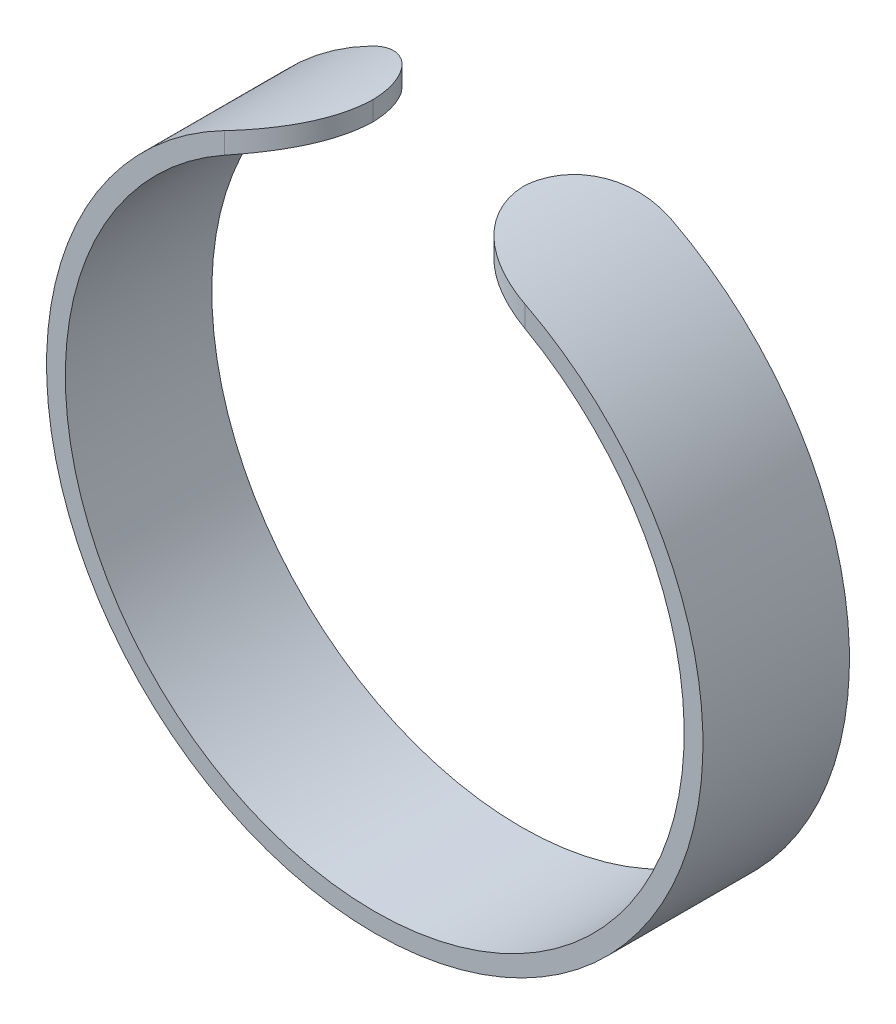
ISO-10303-21;
HEADER;
FILE_DESCRIPTION(('STEP AP214'),'2;1');
FILE_NAME('part.step','',(''),(''),'','','');
FILE_SCHEMA(('AUTOMOTIVE_DESIGN { 1 0 10303 214 1 1 1 1 }'));
ENDSEC;
DATA;
#1=APPLICATION_CONTEXT('core data for automotive mechanical design processes');
#2=APPLICATION_PROTOCOL_DEFINITION('international standard','automotive_design',2000,#1);
#3=PRODUCT_CONTEXT('',#1,'mechanical');
#4=PRODUCT('Part','Part','',(#3));
#5=PRODUCT_RELATED_PRODUCT_CATEGORY('part','',(#4));
#6=PRODUCT_DEFINITION_FORMATION('','',#4);
#7=PRODUCT_DEFINITION_CONTEXT('part definition',#1,'design');
#8=PRODUCT_DEFINITION('design','',#6,#7);
#9=PRODUCT_DEFINITION_SHAPE('','',#8);
#10=(LENGTH_UNIT() NAMED_UNIT(*) SI_UNIT(.MILLI.,.METRE.));
#11=(NAMED_UNIT(*) PLANE_ANGLE_UNIT() SI_UNIT($,.RADIAN.));
#12=(NAMED_UNIT(*) SI_UNIT($,.STERADIAN.) SOLID_ANGLE_UNIT());
#13=UNCERTAINTY_MEASURE_WITH_UNIT(LENGTH_MEASURE(1.E-05),#10,'distance_accuracy_value','');
#14=(GEOMETRIC_REPRESENTATION_CONTEXT(3) GLOBAL_UNCERTAINTY_ASSIGNED_CONTEXT((#13)) GLOBAL_UNIT_ASSIGNED_CONTEXT((#10,
#11,#12)) REPRESENTATION_CONTEXT('',''));
#15=CARTESIAN_POINT('',(0.,0.,0.));
#16=DIRECTION('',(0.,0.,1.));
#17=DIRECTION('',(1.,0.,0.));
#18=AXIS2_PLACEMENT_3D('',#15,#16,#17);
#19=CARTESIAN_POINT('',(0.,0.,7.8));
#20=DIRECTION('',(0.,0.,-1.));
#21=DIRECTION('',(-1.,0.,0.));
#22=AXIS2_PLACEMENT_3D('',#19,#20,#21);
#23=CYLINDRICAL_SURFACE('',#22,16.475);
#24=CARTESIAN_POINT('',(8.,14.4022784655762,7.8));
#25=CARTESIAN_POINT('',(7.88846744762188,14.4642463474608,7.80000788774399));
#26=CARTESIAN_POINT('',(7.77617675518362,14.5249099992052,7.79533467643852));
#27=CARTESIAN_POINT('',(7.55080316158655,14.6433293459696,7.77630530312268));
#28=CARTESIAN_POINT('',(7.43771982470629,14.7010832706541,7.761943320939));
#29=CARTESIAN_POINT('',(7.21119980570815,14.8135174227893,7.72314272976369));
#30=CARTESIAN_POINT('',(7.0977633770068,14.868185395582,7.69866677390953));
#31=CARTESIAN_POINT('',(6.87192034553791,14.9739062988031,7.63940894398816));
#32=CARTESIAN_POINT('',(6.75951354896109,15.0249599222679,7.60462905232517));
#33=CARTESIAN_POINT('',(6.53627338667815,15.1234156563938,7.52446331876255));
#34=CARTESIAN_POINT('',(6.4254484971726,15.1708017168766,7.47903401780325));
#35=CARTESIAN_POINT('',(6.20698432444151,15.2614860875063,7.37765195443916));
#36=CARTESIAN_POINT('',(6.09934483503552,15.3047846626218,7.32169987487098));
#37=CARTESIAN_POINT('',(5.88863188431783,15.3870858280411,7.19954779121797));
#38=CARTESIAN_POINT('',(5.78554978987614,15.4260967689791,7.13336833375987));
#39=CARTESIAN_POINT('',(5.58492224022985,15.4998610304717,6.99100679163707));
#40=CARTESIAN_POINT('',(5.48737617183281,15.534614823061,6.91482581788963));
#41=CARTESIAN_POINT('',(5.3073298439239,15.5969912814089,6.76012559848981));
#42=CARTESIAN_POINT('',(5.22426206567416,15.6249728647939,6.68241017314788));
#43=CARTESIAN_POINT('',(5.06454060768471,15.6774717610102,6.51957385900836));
#44=CARTESIAN_POINT('',(4.98788648729944,15.7019893119152,6.43445347978353));
#45=CARTESIAN_POINT('',(4.84174555147335,15.747666234667,6.25735948097054));
#46=CARTESIAN_POINT('',(4.77226207100134,15.7688240463865,6.16538270650967));
#47=CARTESIAN_POINT('',(4.64122111909267,15.8078894341323,5.97529965553187));
#48=CARTESIAN_POINT('',(4.57966327248068,15.8257971640241,5.87719366947987));
#49=CARTESIAN_POINT('',(4.46817994342531,15.8576218936463,5.68103252209045));
#50=CARTESIAN_POINT('',(4.41780736225381,15.8717015365184,5.58325744375464));
#51=CARTESIAN_POINT('',(4.32517935293063,15.8971933655889,5.38360432710349));
#52=CARTESIAN_POINT('',(4.28292355044174,15.9086056748071,5.28172647826583));
#53=CARTESIAN_POINT('',(4.20693930701637,15.9288679789915,5.07469150724532));
#54=CARTESIAN_POINT('',(4.17320358108666,15.9377201639088,4.96953727352429));
#55=CARTESIAN_POINT('',(4.11451757068579,15.9529709248208,4.75666943455361));
#56=CARTESIAN_POINT('',(4.08956460220929,15.9593702504609,4.64895662196439));
#57=CARTESIAN_POINT('',(4.04614098077245,15.9704404214283,4.41837220097072));
#58=CARTESIAN_POINT('',(4.02884253740499,15.9748025361815,4.29526328990742));
#59=CARTESIAN_POINT('',(4.00576916334118,15.9805963066565,4.04810008934215));
#60=CARTESIAN_POINT('',(3.99997596647018,15.9820326076071,3.92404761276911));
#61=CARTESIAN_POINT('',(4.,15.982040701988,3.8));
#62=B_SPLINE_CURVE_WITH_KNOTS('',3,(#24,#25,#26,#27,#28,#29,#30,#31,#32,#33,#34,#35,#36,#37,#38,
#39,#40,#41,#42,#43,#44,#45,#46,#47,#48,#49,#50,#51,#52,#53,#54,#55,#56,#57,#58,#59,#60,#61),
.UNSPECIFIED.,.F.,.F.,(4,2,2,2,2,2,2,2,2,2,2,2,2,2,2,2,2,2,4),(0.,0.382723087282951,
0.765676286370108,1.15005639748418,1.53436260456088,1.92026529763482,2.30614295762326,
2.6912552389389,3.07632478008658,3.42731043919713,3.77827196426611,4.12939598812655,
4.48050338473172,4.81275949414151,5.14500027657115,5.47695601117586,5.80881021204962,
6.18141333184722,6.55342441809418),.UNSPECIFIED.);
#63=CARTESIAN_POINT('',(8.,14.4022784655762,7.8));
#64=VERTEX_POINT('',#63);
#65=CARTESIAN_POINT('',(4.00125019537356,15.9817277499657,3.90000000000001));
#66=VERTEX_POINT('',#65);
#67=EDGE_CURVE('E102',#64,#66,#62,.T.);
#68=ORIENTED_EDGE('',*,*,#67,.T.);
#69=CARTESIAN_POINT('',(4.,15.982040701988,4.));
#70=CARTESIAN_POINT('',(3.99998646682227,15.9820356285007,3.89073635185237));
#71=CARTESIAN_POINT('',(4.0044763814502,15.9809200835143,3.78147440560181));
#72=CARTESIAN_POINT('',(4.0223656160055,15.9764313018656,3.56373442959625));
#73=CARTESIAN_POINT('',(4.03576447623772,15.9730581816926,3.45525635968572));
#74=CARTESIAN_POINT('',(4.07135638703116,15.9640220127902,3.23996054362574));
#75=CARTESIAN_POINT('',(4.09354066048026,15.9583612494273,3.13314125061883));
#76=CARTESIAN_POINT('',(4.14651104597889,15.9446801083952,2.92181312481799));
#77=CARTESIAN_POINT('',(4.17729704692898,15.9366597612022,2.81730426220147));
#78=CARTESIAN_POINT('',(4.24721921465296,15.9181675928565,2.61130581592207));
#79=CARTESIAN_POINT('',(4.28635791762075,15.9076950270242,2.50981715999607));
#80=CARTESIAN_POINT('',(4.37265609597011,15.8841903576682,2.31057205427012));
#81=CARTESIAN_POINT('',(4.4198185167746,15.8711573139469,2.2128169912273));
#82=CARTESIAN_POINT('',(4.52171368185594,15.8424281336715,2.02181021180976));
#83=CARTESIAN_POINT('',(4.57644255526464,15.8267333578895,1.92855622546284));
#84=CARTESIAN_POINT('',(4.69302432677444,15.7925563830799,1.7471029057345));
#85=CARTESIAN_POINT('',(4.75487984661089,15.7740731574647,1.65890545052293));
#86=CARTESIAN_POINT('',(4.88528361734632,15.7341757370831,1.48800488546056));
#87=CARTESIAN_POINT('',(4.95384586297734,15.712755374404,1.40531389683084));
#88=CARTESIAN_POINT('',(5.0969592534977,15.6669166524259,1.24612739641772));
#89=CARTESIAN_POINT('',(5.17151256385618,15.6424972074091,1.16963414505001));
#90=CARTESIAN_POINT('',(5.32587504514578,15.5906158843385,1.02336517656869));
#91=CARTESIAN_POINT('',(5.40568134420451,15.5631556632016,0.953585839412653));
#92=CARTESIAN_POINT('',(5.5699074982376,15.505139262082,0.821039270438616));
#93=CARTESIAN_POINT('',(5.65432906436876,15.474581930179,0.758274666021808));
#94=CARTESIAN_POINT('',(5.82876942921859,15.409733700578,0.638877085106889));
#95=CARTESIAN_POINT('',(5.91886653640251,15.3753802044731,0.582392363895655));
#96=CARTESIAN_POINT('',(6.1023060869296,15.3035035558948,0.477223445068782));
#97=CARTESIAN_POINT('',(6.19564969310951,15.2659792606739,0.428542078229773));
#98=CARTESIAN_POINT('',(6.47950857707905,15.148707320635,0.294349623450233));
#99=CARTESIAN_POINT('',(6.67383726632993,15.0642659951216,0.220700090300174));
#100=CARTESIAN_POINT('',(7.05789442216052,14.8880649376978,0.107596519199368));
#101=CARTESIAN_POINT('',(7.24745302026462,14.7967860283865,0.066789255277524));
#102=CARTESIAN_POINT('',(7.53097850484846,14.6533690960558,0.0264474295733238));
#103=CARTESIAN_POINT('',(7.62525497889094,14.6045339519934,0.0164778980818698));
#104=CARTESIAN_POINT('',(7.81318434914117,14.5048647210401,0.00325583952835345));
#105=CARTESIAN_POINT('',(7.90683743508968,14.4540312782702,1.16583558752821E-06));
#106=CARTESIAN_POINT('',(8.,14.4022784655762,0.));
#107=B_SPLINE_CURVE_WITH_KNOTS('',3,(#69,#70,#71,#72,#73,#74,#75,#76,#77,#78,#79,#80,#81,#82,
#83,#84,#85,#86,#87,#88,#89,#90,#91,#92,#93,#94,#95,#96,#97,#98,#99,#100,#101,#102,#103,#104,
#105,#106),.UNSPECIFIED.,.F.,.F.,(4,2,2,2,2,2,2,2,2,2,2,2,2,2,2,2,2,2,4),(0.,0.32769064610999,
0.655364384931548,0.982711582153505,1.31005455157201,1.63749705637937,1.96506002229359,
2.29245602842808,2.6199728632011,2.94818831991492,3.27652294829943,3.60467953964878,
3.93295863456296,4.26782293707628,4.60280844274916,5.27283428289181,5.9135913233397,
6.23331236467597,6.55293118055384),.UNSPECIFIED.);
#108=CARTESIAN_POINT('',(8.,14.4022784655762,0.));
#109=VERTEX_POINT('',#108);
#110=EDGE_CURVE('E97',#66,#109,#107,.T.);
#111=ORIENTED_EDGE('',*,*,#110,.T.);
#112=CARTESIAN_POINT('',(0.,0.,0.));
#113=DIRECTION('',(0.,0.,-1.));
#114=DIRECTION('',(1.,0.,0.));
#115=AXIS2_PLACEMENT_3D('',#112,#113,#114);
#116=CIRCLE('',#115,16.475);
#117=CARTESIAN_POINT('',(-8.00000000000001,14.4022784655762,0.));
#118=VERTEX_POINT('',#117);
#119=EDGE_CURVE('E99',#109,#118,#116,.T.);
#120=ORIENTED_EDGE('',*,*,#119,.T.);
#121=CARTESIAN_POINT('',(-8.00000000000001,14.4022784655762,0.));
#122=CARTESIAN_POINT('',(-7.88846744762188,14.4642463474608,-7.88774398981053E-06));
#123=CARTESIAN_POINT('',(-7.77617675518363,14.5249099992052,0.00466532356147978));
#124=CARTESIAN_POINT('',(-7.55080316158656,14.6433293459696,0.0236946968773198));
#125=CARTESIAN_POINT('',(-7.43771982470629,14.7010832706541,0.0380566790609986));
#126=CARTESIAN_POINT('',(-7.21119980570816,14.8135174227893,0.07685727023631));
#127=CARTESIAN_POINT('',(-7.0977633770068,14.868185395582,0.101333226090475));
#128=CARTESIAN_POINT('',(-6.87192034553791,14.9739062988031,0.160591056011843));
#129=CARTESIAN_POINT('',(-6.75951354896109,15.0249599222679,0.19537094767483));
#130=CARTESIAN_POINT('',(-6.53627338667815,15.1234156563938,0.27553668123745));
#131=CARTESIAN_POINT('',(-6.42544849717261,15.1708017168766,0.320965982196753));
#132=CARTESIAN_POINT('',(-6.20698432444151,15.2614860875063,0.422348045560836));
#133=CARTESIAN_POINT('',(-6.09934483503552,15.3047846626218,0.478300125129019));
#134=CARTESIAN_POINT('',(-5.88863188431783,15.3870858280411,0.600452208782035));
#135=CARTESIAN_POINT('',(-5.78554978987614,15.4260967689791,0.666631666240133));
#136=CARTESIAN_POINT('',(-5.58492224022985,15.4998610304717,0.808993208362928));
#137=CARTESIAN_POINT('',(-5.48737617183281,15.534614823061,0.885174182110369));
#138=CARTESIAN_POINT('',(-5.3073298439239,15.5969912814089,1.0398744015102));
#139=CARTESIAN_POINT('',(-5.22426206567416,15.6249728647939,1.11758982685212));
#140=CARTESIAN_POINT('',(-5.06454060768471,15.6774717610102,1.28042614099164));
#141=CARTESIAN_POINT('',(-4.98788648729944,15.7019893119152,1.36554652021647));
#142=CARTESIAN_POINT('',(-4.84174555147335,15.747666234667,1.54264051902947));
#143=CARTESIAN_POINT('',(-4.77226207100134,15.7688240463865,1.63461729349034));
#144=CARTESIAN_POINT('',(-4.64122111909267,15.8078894341323,1.82470034446814));
#145=CARTESIAN_POINT('',(-4.57966327248068,15.8257971640241,1.92280633052013));
#146=CARTESIAN_POINT('',(-4.46817994342531,15.8576218936463,2.11896747790955));
#147=CARTESIAN_POINT('',(-4.41780736225381,15.8717015365184,2.21674255624536));
#148=CARTESIAN_POINT('',(-4.32517935293064,15.8971933655889,2.41639567289651));
#149=CARTESIAN_POINT('',(-4.28292355044174,15.9086056748071,2.51827352173417));
#150=CARTESIAN_POINT('',(-4.20693930701637,15.9288679789915,2.72530849275468));
#151=CARTESIAN_POINT('',(-4.17320358108666,15.9377201639088,2.83046272647572));
#152=CARTESIAN_POINT('',(-4.11451757068579,15.9529709248208,3.04333056544639));
#153=CARTESIAN_POINT('',(-4.08956460220929,15.9593702504609,3.15104337803561));
#154=CARTESIAN_POINT('',(-4.04614098077245,15.9704404214283,3.38162779902928));
#155=CARTESIAN_POINT('',(-4.02884253740499,15.9748025361815,3.50473671009259));
#156=CARTESIAN_POINT('',(-4.00576916334118,15.9805963066565,3.75189991065785));
#157=CARTESIAN_POINT('',(-3.99997596647018,15.9820326076071,3.87595238723089));
#158=CARTESIAN_POINT('',(-4.,15.982040701988,4.));
#159=B_SPLINE_CURVE_WITH_KNOTS('',3,(#121,#122,#123,#124,#125,#126,#127,#128,#129,#130,#131,
#132,#133,#134,#135,#136,#137,#138,#139,#140,#141,#142,#143,#144,#145,#146,#147,#148,#149,#150,
#151,#152,#153,#154,#155,#156,#157,#158),.UNSPECIFIED.,.F.,.F.,(4,2,2,2,2,2,2,2,2,2,2,2,2,2,2,2,
2,2,4),(0.,0.382723087282953,0.765676286370109,1.15005639748419,1.53436260456088,
1.92026529763483,2.30614295762326,2.69125523893891,3.07632478008659,3.42731043919714,
3.77827196426612,4.12939598812656,4.48050338473173,4.81275949414152,5.14500027657116,
5.47695601117586,5.80881021204963,6.18141333184723,6.55342441809418),.UNSPECIFIED.);
#160=CARTESIAN_POINT('',(-4.00125019537356,15.9817277499657,3.90000000000001));
#161=VERTEX_POINT('',#160);
#162=EDGE_CURVE('E177',#118,#161,#159,.T.);
#163=ORIENTED_EDGE('',*,*,#162,.T.);
#164=CARTESIAN_POINT('',(-4.,15.982040701988,3.8));
#165=CARTESIAN_POINT('',(-3.99998646682227,15.9820356285007,3.90926364814763));
#166=CARTESIAN_POINT('',(-4.0044763814502,15.9809200835143,4.01852559439819));
#167=CARTESIAN_POINT('',(-4.0223656160055,15.9764313018656,4.23626557040375));
#168=CARTESIAN_POINT('',(-4.03576447623772,15.9730581816926,4.34474364031428));
#169=CARTESIAN_POINT('',(-4.07135638703116,15.9640220127902,4.56003945637426));
#170=CARTESIAN_POINT('',(-4.09354066048026,15.9583612494273,4.66685874938117));
#171=CARTESIAN_POINT('',(-4.1465110459789,15.9446801083952,4.87818687518201));
#172=CARTESIAN_POINT('',(-4.17729704692898,15.9366597612022,4.98269573779853));
#173=CARTESIAN_POINT('',(-4.24721921465297,15.9181675928565,5.18869418407793));
#174=CARTESIAN_POINT('',(-4.28635791762075,15.9076950270243,5.29018284000393));
#175=CARTESIAN_POINT('',(-4.37265609597011,15.8841903576682,5.48942794572988));
#176=CARTESIAN_POINT('',(-4.4198185167746,15.8711573139469,5.5871830087727));
#177=CARTESIAN_POINT('',(-4.52171368185595,15.8424281336715,5.77818978819024));
#178=CARTESIAN_POINT('',(-4.57644255526464,15.8267333578895,5.87144377453716));
#179=CARTESIAN_POINT('',(-4.69302432677444,15.7925563830799,6.0528970942655));
#180=CARTESIAN_POINT('',(-4.7548798466109,15.7740731574647,6.14109454947707));
#181=CARTESIAN_POINT('',(-4.88528361734633,15.7341757370831,6.31199511453944));
#182=CARTESIAN_POINT('',(-4.95384586297734,15.712755374404,6.39468610316916));
#183=CARTESIAN_POINT('',(-5.0969592534977,15.6669166524259,6.55387260358228));
#184=CARTESIAN_POINT('',(-5.17151256385618,15.6424972074091,6.63036585494999));
#185=CARTESIAN_POINT('',(-5.32587504514578,15.5906158843385,6.77663482343131));
#186=CARTESIAN_POINT('',(-5.40568134420451,15.5631556632016,6.84641416058735));
#187=CARTESIAN_POINT('',(-5.56990749823761,15.505139262082,6.97896072956138));
#188=CARTESIAN_POINT('',(-5.65432906436876,15.474581930179,7.04172533397819));
#189=CARTESIAN_POINT('',(-5.82876942921859,15.409733700578,7.16112291489311));
#190=CARTESIAN_POINT('',(-5.91886653640252,15.3753802044731,7.21760763610434));
#191=CARTESIAN_POINT('',(-6.1023060869296,15.3035035558948,7.32277655493122));
#192=CARTESIAN_POINT('',(-6.19564969310951,15.2659792606739,7.37145792177023));
#193=CARTESIAN_POINT('',(-6.47950857707906,15.148707320635,7.50565037654977));
#194=CARTESIAN_POINT('',(-6.67383726632994,15.0642659951216,7.57929990969983));
#195=CARTESIAN_POINT('',(-7.05789442216053,14.8880649376978,7.69240348080063));
#196=CARTESIAN_POINT('',(-7.24745302026463,14.7967860283865,7.73321074472248));
#197=CARTESIAN_POINT('',(-7.53097850484847,14.6533690960558,7.77355257042668));
#198=CARTESIAN_POINT('',(-7.62525497889094,14.6045339519934,7.78352210191813));
#199=CARTESIAN_POINT('',(-7.81318434914117,14.5048647210401,7.79674416047165));
#200=CARTESIAN_POINT('',(-7.90683743508969,14.4540312782702,7.79999883416441));
#201=CARTESIAN_POINT('',(-8.,14.4022784655762,7.8));
#202=B_SPLINE_CURVE_WITH_KNOTS('',3,(#164,#165,#166,#167,#168,#169,#170,#171,#172,#173,#174,
#175,#176,#177,#178,#179,#180,#181,#182,#183,#184,#185,#186,#187,#188,#189,#190,#191,#192,#193,
#194,#195,#196,#197,#198,#199,#200,#201),.UNSPECIFIED.,.F.,.F.,(4,2,2,2,2,2,2,2,2,2,2,2,2,2,2,2,
2,2,4),(0.,0.327690646109989,0.655364384931547,0.982711582153504,1.31005455157201,
1.63749705637937,1.96506002229359,2.29245602842808,2.6199728632011,2.94818831991492,
3.27652294829943,3.60467953964878,3.93295863456296,4.26782293707628,4.60280844274916,
5.27283428289181,5.9135913233397,6.23331236467597,6.55293118055384),.UNSPECIFIED.);
#203=CARTESIAN_POINT('',(-8.,14.4022784655762,7.8));
#204=VERTEX_POINT('',#203);
#205=EDGE_CURVE('E186',#161,#204,#202,.T.);
#206=ORIENTED_EDGE('',*,*,#205,.T.);
#207=CARTESIAN_POINT('',(0.,0.,7.8));
#208=DIRECTION('',(0.,0.,-1.));
#209=DIRECTION('',(1.,0.,0.));
#210=AXIS2_PLACEMENT_3D('',#207,#208,#209);
#211=CIRCLE('',#210,16.475);
#212=EDGE_CURVE('E194',#64,#204,#211,.T.);
#213=ORIENTED_EDGE('',*,*,#212,.F.);
#214=EDGE_LOOP('',(#68,#111,#120,#163,#206,#213));
#215=FACE_BOUND('',#214,.T.);
#216=ADVANCED_FACE('F41',(#215),#23,.F.);
#217=CARTESIAN_POINT('',(0.,0.,7.8));
#218=DIRECTION('',(0.,0.,-1.));
#219=DIRECTION('',(-1.,0.,0.));
#220=AXIS2_PLACEMENT_3D('',#217,#218,#219);
#221=CYLINDRICAL_SURFACE('',#220,17.475);
#222=CARTESIAN_POINT('',(0.,0.,0.));
#223=DIRECTION('',(0.,0.,1.));
#224=DIRECTION('',(1.,0.,0.));
#225=AXIS2_PLACEMENT_3D('',#222,#223,#224);
#226=CIRCLE('',#225,17.475);
#227=CARTESIAN_POINT('',(-8.,15.5362680525279,0.));
#228=VERTEX_POINT('',#227);
#229=CARTESIAN_POINT('',(8.,15.5362680525279,0.));
#230=VERTEX_POINT('',#229);
#231=EDGE_CURVE('E118',#228,#230,#226,.T.);
#232=ORIENTED_EDGE('',*,*,#231,.T.);
#233=CARTESIAN_POINT('',(8.,15.5362680525279,0.));
#234=CARTESIAN_POINT('',(7.88831223411505,15.5937925981794,-8.45232300355863E-06));
#235=CARTESIAN_POINT('',(7.77597043682962,15.6501028840733,0.00467818104971376));
#236=CARTESIAN_POINT('',(7.55071055105449,15.7600125213226,0.023707082823339));
#237=CARTESIAN_POINT('',(7.43779219113705,15.8136104348894,0.0380544157524715));
#238=CARTESIAN_POINT('',(7.21187608353728,15.9179152102993,0.0767312959278657));
#239=CARTESIAN_POINT('',(7.09887919761449,15.9686124775443,0.101092009829138));
#240=CARTESIAN_POINT('',(6.87409911155586,16.0666552312621,0.159968588235593));
#241=CARTESIAN_POINT('',(6.76231570725417,16.1140012892076,0.194482716105534));
#242=CARTESIAN_POINT('',(6.5405275701669,16.2052942004141,0.273894232182569));
#243=CARTESIAN_POINT('',(6.43053091185611,16.2492278816036,0.318829422350639));
#244=CARTESIAN_POINT('',(6.21381880722255,16.3333275765383,0.418966284691857));
#245=CARTESIAN_POINT('',(6.10710316807194,16.3734938119847,0.47416735218289));
#246=CARTESIAN_POINT('',(5.89823965895771,16.4498857159293,0.594547477306238));
#247=CARTESIAN_POINT('',(5.79608420676996,16.4861180808268,0.659709109323706));
#248=CARTESIAN_POINT('',(5.59726762898229,16.5546754015849,0.799741013832444));
#249=CARTESIAN_POINT('',(5.50060598342004,16.5870007275552,0.874610365326548));
#250=CARTESIAN_POINT('',(5.32110800951283,16.645409103996,1.02740276499331));
#251=CARTESIAN_POINT('',(5.23778079582017,16.6717817797316,1.10463943308278));
#252=CARTESIAN_POINT('',(5.07751724493648,16.7212882548329,1.26649179647776));
#253=CARTESIAN_POINT('',(5.00058291552818,16.744421038213,1.351109793027));
#254=CARTESIAN_POINT('',(4.85388391661484,16.7875336239185,1.52713054018805));
#255=CARTESIAN_POINT('',(4.78412094138622,16.8075126817513,1.61853488537175));
#256=CARTESIAN_POINT('',(4.65247922204757,16.8444274905467,1.80743160081938));
#257=CARTESIAN_POINT('',(4.59060020670919,16.8613633462114,1.90492376147488));
#258=CARTESIAN_POINT('',(4.47808318227183,16.8915845176211,2.10046985291041));
#259=CARTESIAN_POINT('',(4.42705014768283,16.9050052861443,2.19827586132157));
#260=CARTESIAN_POINT('',(4.33315676124616,16.9293156751808,2.39799148165521));
#261=CARTESIAN_POINT('',(4.29029320309369,16.9402062890822,2.49989946456161));
#262=CARTESIAN_POINT('',(4.21311534347363,16.9595657320664,2.70705263274968));
#263=CARTESIAN_POINT('',(4.17879566050956,16.968036086088,2.81229567005624));
#264=CARTESIAN_POINT('',(4.11897441521408,16.9826562747012,3.02537822327004));
#265=CARTESIAN_POINT('',(4.09347023512275,16.9888067982151,3.1332169581941));
#266=CARTESIAN_POINT('',(4.04839436816817,16.9996112512168,3.36679302062295));
#267=CARTESIAN_POINT('',(4.03025179126776,17.0039108195994,3.49282505935065));
#268=CARTESIAN_POINT('',(4.00605102832593,17.0096208613302,3.74590818151692));
#269=CARTESIAN_POINT('',(3.99997390163788,17.0110358630373,3.87295735288457));
#270=CARTESIAN_POINT('',(4.,17.0110442066323,4.));
#271=B_SPLINE_CURVE_WITH_KNOTS('',3,(#233,#234,#235,#236,#237,#238,#239,#240,#241,#242,#243,
#244,#245,#246,#247,#248,#249,#250,#251,#252,#253,#254,#255,#256,#257,#258,#259,#260,#261,#262,
#263,#264,#265,#266,#267,#268,#269,#270),.UNSPECIFIED.,.F.,.F.,(4,2,2,2,2,2,2,2,2,2,2,2,2,2,2,2,
2,2,4),(0.,0.376837068812212,0.753871844776275,1.13208913632969,1.51024177534614,
1.88978821752262,2.26931231067916,2.64817988386021,3.02701153913104,3.37648284826877,
3.72606350259691,4.0757265585929,4.42537758203663,4.75837497948991,5.09124141386912,
5.42389765349678,5.75645502595591,6.13804463702498,6.519034743999),.UNSPECIFIED.);
#272=CARTESIAN_POINT('',(4.00125019537356,17.0107501855157,3.89999999999999));
#273=VERTEX_POINT('',#272);
#274=EDGE_CURVE('E60',#230,#273,#271,.T.);
#275=ORIENTED_EDGE('',*,*,#274,.T.);
#276=CARTESIAN_POINT('',(4.,17.0110442066323,3.8));
#277=CARTESIAN_POINT('',(3.99998661376344,17.0110393543683,3.90962875145014));
#278=CARTESIAN_POINT('',(4.00450635734435,17.009984324539,4.01925579699567));
#279=CARTESIAN_POINT('',(4.02251564994984,17.0057387710404,4.23772360208198));
#280=CARTESIAN_POINT('',(4.0360047396092,17.0025483567346,4.34656440160181));
#281=CARTESIAN_POINT('',(4.07183889833763,16.9940010502603,4.56258339500892));
#282=CARTESIAN_POINT('',(4.09417536334612,16.9886462628385,4.66976309938999));
#283=CARTESIAN_POINT('',(4.14751406173193,16.9757035090121,4.88180473778929));
#284=CARTESIAN_POINT('',(4.1785161838687,16.9681155712744,4.98666670154158));
#285=CARTESIAN_POINT('',(4.24893771864282,16.9506184958984,5.19336151589775));
#286=CARTESIAN_POINT('',(4.28835968461452,16.9407086540495,5.29519343693874));
#287=CARTESIAN_POINT('',(4.37529594240196,16.9184639757925,5.49511238577233));
#288=CARTESIAN_POINT('',(4.42281320718233,16.9061282482302,5.59319802149863));
#289=CARTESIAN_POINT('',(4.52549469608494,16.8789318474822,5.78484890463037));
#290=CARTESIAN_POINT('',(4.58065497423589,16.8640724763275,5.87841645125568));
#291=CARTESIAN_POINT('',(4.69818347318113,16.831708521704,6.06047596336567));
#292=CARTESIAN_POINT('',(4.76055434624293,16.8142029641578,6.14896604318669));
#293=CARTESIAN_POINT('',(4.89206536852688,16.7764122825316,6.32040389098573));
#294=CARTESIAN_POINT('',(4.96121805918078,16.7561219799388,6.40334089461539));
#295=CARTESIAN_POINT('',(5.10561026409928,16.7126913768317,6.56298688668055));
#296=CARTESIAN_POINT('',(5.18085198399258,16.6895500419882,6.63969359797625));
#297=CARTESIAN_POINT('',(5.33670047397737,16.6403703045393,6.78634870813549));
#298=CARTESIAN_POINT('',(5.41730451971805,16.6143333686069,6.85630049524223));
#299=CARTESIAN_POINT('',(5.58324110567744,16.5593082154336,6.98913431423084));
#300=CARTESIAN_POINT('',(5.66857539358144,16.5303189040198,7.05201370672819));
#301=CARTESIAN_POINT('',(5.84480307118344,16.4688419748355,7.17144691648194));
#302=CARTESIAN_POINT('',(5.93576890561389,16.4363007512507,7.22786639953494));
#303=CARTESIAN_POINT('',(6.12106259726775,16.3682006797189,7.332839183714));
#304=CARTESIAN_POINT('',(6.21539167530576,16.3326407294095,7.38138959226152));
#305=CARTESIAN_POINT('',(6.50236316225404,16.2214916826003,7.51504209389016));
#306=CARTESIAN_POINT('',(6.69900767434215,16.1414272474245,7.58815742683661));
#307=CARTESIAN_POINT('',(7.08059924376164,15.9774959371878,7.69755161601184));
#308=CARTESIAN_POINT('',(7.26520304196975,15.894462835306,7.73633522146407));
#309=CARTESIAN_POINT('',(7.5417107632695,15.7641561660415,7.77474748205268));
#310=CARTESIAN_POINT('',(7.63372461775375,15.7198069046945,7.78425803384972));
#311=CARTESIAN_POINT('',(7.81729282256715,15.6293327972406,7.79688337277185));
#312=CARTESIAN_POINT('',(7.90884727364532,15.5832083615653,7.79999962935616));
#313=CARTESIAN_POINT('',(8.,15.5362680525279,7.8));
#314=B_SPLINE_CURVE_WITH_KNOTS('',3,(#276,#277,#278,#279,#280,#281,#282,#283,#284,#285,#286,
#287,#288,#289,#290,#291,#292,#293,#294,#295,#296,#297,#298,#299,#300,#301,#302,#303,#304,#305,
#306,#307,#308,#309,#310,#311,#312,#313),.UNSPECIFIED.,.F.,.F.,(4,2,2,2,2,2,2,2,2,2,2,2,2,2,2,2,
2,2,4),(0.,0.328785649683879,0.657554461901893,0.986004328815689,1.31444997963036,
1.64299537401821,1.97166168645126,2.30015894138935,2.62877741398425,2.95801548146424,
3.2873733472785,3.616565140885,3.94587938253131,4.28112514972868,4.61649387117568,
5.28716503819417,5.90349293853731,6.21106081346057,6.51855799895266),.UNSPECIFIED.);
#315=CARTESIAN_POINT('',(8.,15.5362680525279,7.8));
#316=VERTEX_POINT('',#315);
#317=EDGE_CURVE('E153',#273,#316,#314,.T.);
#318=ORIENTED_EDGE('',*,*,#317,.T.);
#319=CARTESIAN_POINT('',(0.,0.,7.8));
#320=DIRECTION('',(0.,0.,1.));
#321=DIRECTION('',(1.,0.,0.));
#322=AXIS2_PLACEMENT_3D('',#319,#320,#321);
#323=CIRCLE('',#322,17.475);
#324=CARTESIAN_POINT('',(-8.,15.5362680525279,7.8));
#325=VERTEX_POINT('',#324);
#326=EDGE_CURVE('E192',#325,#316,#323,.T.);
#327=ORIENTED_EDGE('',*,*,#326,.F.);
#328=CARTESIAN_POINT('',(-8.,15.5362680525279,7.8));
#329=CARTESIAN_POINT('',(-7.88831223411505,15.5937925981794,7.800008452323));
#330=CARTESIAN_POINT('',(-7.77597043682963,15.6501028840733,7.79532181895029));
#331=CARTESIAN_POINT('',(-7.55071055105449,15.7600125213226,7.77629291717666));
#332=CARTESIAN_POINT('',(-7.43779219113705,15.8136104348894,7.76194558424753));
#333=CARTESIAN_POINT('',(-7.21187608353729,15.9179152102993,7.72326870407213));
#334=CARTESIAN_POINT('',(-7.0988791976145,15.9686124775443,7.69890799017086));
#335=CARTESIAN_POINT('',(-6.87409911155587,16.0666552312621,7.64003141176441));
#336=CARTESIAN_POINT('',(-6.76231570725418,16.1140012892076,7.60551728389447));
#337=CARTESIAN_POINT('',(-6.5405275701669,16.2052942004141,7.52610576781743));
#338=CARTESIAN_POINT('',(-6.43053091185612,16.2492278816036,7.48117057764936));
#339=CARTESIAN_POINT('',(-6.21381880722255,16.3333275765383,7.38103371530814));
#340=CARTESIAN_POINT('',(-6.10710316807195,16.3734938119847,7.32583264781711));
#341=CARTESIAN_POINT('',(-5.89823965895772,16.4498857159293,7.20545252269376));
#342=CARTESIAN_POINT('',(-5.79608420676996,16.4861180808268,7.1402908906763));
#343=CARTESIAN_POINT('',(-5.5972676289823,16.5546754015849,7.00025898616756));
#344=CARTESIAN_POINT('',(-5.50060598342004,16.5870007275552,6.92538963467346));
#345=CARTESIAN_POINT('',(-5.32110800951283,16.645409103996,6.7725972350067));
#346=CARTESIAN_POINT('',(-5.23778079582017,16.6717817797316,6.69536056691723));
#347=CARTESIAN_POINT('',(-5.07751724493648,16.7212882548329,6.53350820352224));
#348=CARTESIAN_POINT('',(-5.00058291552818,16.744421038213,6.448890206973));
#349=CARTESIAN_POINT('',(-4.85388391661485,16.7875336239185,6.27286945981195));
#350=CARTESIAN_POINT('',(-4.78412094138622,16.8075126817513,6.18146511462826));
#351=CARTESIAN_POINT('',(-4.65247922204758,16.8444274905467,5.99256839918063));
#352=CARTESIAN_POINT('',(-4.59060020670919,16.8613633462114,5.89507623852513));
#353=CARTESIAN_POINT('',(-4.47808318227183,16.8915845176211,5.69953014708959));
#354=CARTESIAN_POINT('',(-4.42705014768283,16.9050052861443,5.60172413867843));
#355=CARTESIAN_POINT('',(-4.33315676124616,16.9293156751808,5.40200851834479));
#356=CARTESIAN_POINT('',(-4.29029320309369,16.9402062890822,5.30010053543839));
#357=CARTESIAN_POINT('',(-4.21311534347363,16.9595657320664,5.09294736725032));
#358=CARTESIAN_POINT('',(-4.17879566050956,16.968036086088,4.98770432994377));
#359=CARTESIAN_POINT('',(-4.11897441521408,16.9826562747012,4.77462177672996));
#360=CARTESIAN_POINT('',(-4.09347023512275,16.9888067982151,4.6667830418059));
#361=CARTESIAN_POINT('',(-4.04839436816817,16.9996112512168,4.43320697937705));
#362=CARTESIAN_POINT('',(-4.03025179126776,17.0039108195994,4.30717494064935));
#363=CARTESIAN_POINT('',(-4.00605102832593,17.0096208613302,4.05409181848308));
#364=CARTESIAN_POINT('',(-3.99997390163788,17.0110358630373,3.92704264711543));
#365=CARTESIAN_POINT('',(-4.,17.0110442066323,3.8));
#366=B_SPLINE_CURVE_WITH_KNOTS('',3,(#328,#329,#330,#331,#332,#333,#334,#335,#336,#337,#338,
#339,#340,#341,#342,#343,#344,#345,#346,#347,#348,#349,#350,#351,#352,#353,#354,#355,#356,#357,
#358,#359,#360,#361,#362,#363,#364,#365),.UNSPECIFIED.,.F.,.F.,(4,2,2,2,2,2,2,2,2,2,2,2,2,2,2,2,
2,2,4),(0.,0.376837068812211,0.753871844776275,1.13208913632969,1.51024177534614,
1.88978821752262,2.26931231067916,2.6481798838602,3.02701153913104,3.37648284826876,
3.72606350259691,4.0757265585929,4.42537758203663,4.75837497948991,5.09124141386912,
5.42389765349678,5.75645502595591,6.13804463702498,6.519034743999),.UNSPECIFIED.);
#367=CARTESIAN_POINT('',(-4.00125019537356,17.0107501855157,3.90000000000002));
#368=VERTEX_POINT('',#367);
#369=EDGE_CURVE('E67',#325,#368,#366,.T.);
#370=ORIENTED_EDGE('',*,*,#369,.T.);
#371=CARTESIAN_POINT('',(-4.,17.0110442066323,4.));
#372=CARTESIAN_POINT('',(-3.99998661376344,17.0110393543683,3.89037124854986));
#373=CARTESIAN_POINT('',(-4.00450635734436,17.009984324539,3.78074420300433));
#374=CARTESIAN_POINT('',(-4.02251564994984,17.0057387710404,3.56227639791802));
#375=CARTESIAN_POINT('',(-4.0360047396092,17.0025483567346,3.45343559839819));
#376=CARTESIAN_POINT('',(-4.07183889833763,16.9940010502603,3.23741660499108));
#377=CARTESIAN_POINT('',(-4.09417536334612,16.9886462628385,3.13023690061001));
#378=CARTESIAN_POINT('',(-4.14751406173194,16.9757035090121,2.91819526221071));
#379=CARTESIAN_POINT('',(-4.1785161838687,16.9681155712744,2.81333329845842));
#380=CARTESIAN_POINT('',(-4.24893771864282,16.9506184958984,2.60663848410225));
#381=CARTESIAN_POINT('',(-4.28835968461452,16.9407086540495,2.50480656306126));
#382=CARTESIAN_POINT('',(-4.37529594240197,16.9184639757925,2.30488761422767));
#383=CARTESIAN_POINT('',(-4.42281320718233,16.9061282482302,2.20680197850137));
#384=CARTESIAN_POINT('',(-4.52549469608495,16.8789318474822,2.01515109536963));
#385=CARTESIAN_POINT('',(-4.58065497423589,16.8640724763275,1.92158354874432));
#386=CARTESIAN_POINT('',(-4.69818347318114,16.831708521704,1.73952403663433));
#387=CARTESIAN_POINT('',(-4.76055434624294,16.8142029641578,1.65103395681331));
#388=CARTESIAN_POINT('',(-4.89206536852689,16.7764122825316,1.47959610901427));
#389=CARTESIAN_POINT('',(-4.96121805918078,16.7561219799388,1.39665910538461));
#390=CARTESIAN_POINT('',(-5.10561026409928,16.7126913768317,1.23701311331945));
#391=CARTESIAN_POINT('',(-5.18085198399258,16.6895500419882,1.16030640202375));
#392=CARTESIAN_POINT('',(-5.33670047397737,16.6403703045393,1.01365129186451));
#393=CARTESIAN_POINT('',(-5.41730451971805,16.6143333686069,0.943699504757769));
#394=CARTESIAN_POINT('',(-5.58324110567744,16.5593082154336,0.810865685769157));
#395=CARTESIAN_POINT('',(-5.66857539358144,16.5303189040198,0.747986293271813));
#396=CARTESIAN_POINT('',(-5.84480307118344,16.4688419748355,0.628553083518064));
#397=CARTESIAN_POINT('',(-5.9357689056139,16.4363007512507,0.572133600465055));
#398=CARTESIAN_POINT('',(-6.12106259726775,16.3682006797189,0.467160816286003));
#399=CARTESIAN_POINT('',(-6.21539167530576,16.3326407294095,0.418610407738483));
#400=CARTESIAN_POINT('',(-6.50236316225404,16.2214916826003,0.284957906109837));
#401=CARTESIAN_POINT('',(-6.69900767434216,16.1414272474245,0.211842573163391));
#402=CARTESIAN_POINT('',(-7.08059924376164,15.9774959371878,0.102448383988159));
#403=CARTESIAN_POINT('',(-7.26520304196975,15.894462835306,0.0636647785359322));
#404=CARTESIAN_POINT('',(-7.5417107632695,15.7641561660415,0.0252525179473201));
#405=CARTESIAN_POINT('',(-7.63372461775375,15.7198069046945,0.0157419661502804));
#406=CARTESIAN_POINT('',(-7.81729282256716,15.6293327972406,0.00311662722814849));
#407=CARTESIAN_POINT('',(-7.90884727364532,15.5832083615653,3.70643833560563E-07));
#408=CARTESIAN_POINT('',(-8.00000000000001,15.5362680525279,0.));
#409=B_SPLINE_CURVE_WITH_KNOTS('',3,(#371,#372,#373,#374,#375,#376,#377,#378,#379,#380,#381,
#382,#383,#384,#385,#386,#387,#388,#389,#390,#391,#392,#393,#394,#395,#396,#397,#398,#399,#400,
#401,#402,#403,#404,#405,#406,#407,#408),.UNSPECIFIED.,.F.,.F.,(4,2,2,2,2,2,2,2,2,2,2,2,2,2,2,2,
2,2,4),(0.,0.328785649683878,0.657554461901893,0.986004328815688,1.31444997963036,
1.64299537401821,1.97166168645126,2.30015894138935,2.62877741398425,2.95801548146424,
3.2873733472785,3.616565140885,3.94587938253131,4.28112514972868,4.61649387117568,
5.28716503819417,5.90349293853732,6.21106081346057,6.51855799895266),.UNSPECIFIED.);
#410=EDGE_CURVE('E127',#368,#228,#409,.T.);
#411=ORIENTED_EDGE('',*,*,#410,.T.);
#412=EDGE_LOOP('',(#232,#275,#318,#327,#370,#411));
#413=FACE_BOUND('',#412,.T.);
#414=ADVANCED_FACE('F140',(#413),#221,.T.);
#415=CARTESIAN_POINT('',(0.,0.,7.8));
#416=DIRECTION('',(0.,0.,1.));
#417=DIRECTION('',(1.,0.,0.));
#418=AXIS2_PLACEMENT_3D('',#415,#416,#417);
#419=PLANE('',#418);
#420=ORIENTED_EDGE('',*,*,#326,.T.);
#421=DIRECTION('',(0.,-1.,0.));
#422=VECTOR('',#421,1.);
#423=CARTESIAN_POINT('',(8.,15.982040701988,7.8));
#424=LINE('',#423,#422);
#425=EDGE_CURVE('E11',#316,#64,#424,.T.);
#426=ORIENTED_EDGE('',*,*,#425,.T.);
#427=ORIENTED_EDGE('',*,*,#212,.T.);
#428=DIRECTION('',(0.,1.,0.));
#429=VECTOR('',#428,1.);
#430=CARTESIAN_POINT('',(-8.,17.0110442066324,7.8));
#431=LINE('',#430,#429);
#432=EDGE_CURVE('E52',#204,#325,#431,.T.);
#433=ORIENTED_EDGE('',*,*,#432,.T.);
#434=EDGE_LOOP('',(#420,#426,#427,#433));
#435=FACE_BOUND('',#434,.T.);
#436=ADVANCED_FACE('F145',(#435),#419,.T.);
#437=CARTESIAN_POINT('',(0.,0.,0.));
#438=DIRECTION('',(0.,0.,1.));
#439=DIRECTION('',(1.,0.,0.));
#440=AXIS2_PLACEMENT_3D('',#437,#438,#439);
#441=PLANE('',#440);
#442=ORIENTED_EDGE('',*,*,#119,.F.);
#443=DIRECTION('',(0.,-1.,0.));
#444=VECTOR('',#443,1.);
#445=CARTESIAN_POINT('',(8.,0.,0.));
#446=LINE('',#445,#444);
#447=EDGE_CURVE('E115',#109,#230,#446,.F.);
#448=ORIENTED_EDGE('',*,*,#447,.T.);
#449=ORIENTED_EDGE('',*,*,#231,.F.);
#450=DIRECTION('',(0.,1.,0.));
#451=VECTOR('',#450,1.);
#452=CARTESIAN_POINT('',(-8.00000000000002,0.,0.));
#453=LINE('',#452,#451);
#454=EDGE_CURVE('E108',#228,#118,#453,.F.);
#455=ORIENTED_EDGE('',*,*,#454,.T.);
#456=EDGE_LOOP('',(#442,#448,#449,#455));
#457=FACE_BOUND('',#456,.T.);
#458=ADVANCED_FACE('F113',(#457),#441,.F.);
#459=CARTESIAN_POINT('',(8.,0.,3.8));
#460=DIRECTION('',(0.,1.,0.));
#461=DIRECTION('',(0.,0.,1.));
#462=AXIS2_PLACEMENT_3D('',#459,#460,#461);
#463=CYLINDRICAL_SURFACE('',#462,4.);
#464=ORIENTED_EDGE('',*,*,#425,.F.);
#465=ORIENTED_EDGE('',*,*,#317,.F.);
#466=DIRECTION('',(0.,1.,0.));
#467=VECTOR('',#466,1.);
#468=CARTESIAN_POINT('',(4.00125019537356,15.7066613361043,3.9));
#469=LINE('',#468,#467);
#470=EDGE_CURVE('E119',#66,#273,#469,.T.);
#471=ORIENTED_EDGE('',*,*,#470,.F.);
#472=ORIENTED_EDGE('',*,*,#67,.F.);
#473=EDGE_LOOP('',(#464,#465,#471,#472));
#474=FACE_BOUND('',#473,.T.);
#475=ADVANCED_FACE('F163',(#474),#463,.T.);
#476=CARTESIAN_POINT('',(8.,17.0110442066323,4.));
#477=DIRECTION('',(0.,-1.,0.));
#478=DIRECTION('',(0.,0.,-1.));
#479=AXIS2_PLACEMENT_3D('',#476,#477,#478);
#480=CYLINDRICAL_SURFACE('',#479,4.);
#481=ORIENTED_EDGE('',*,*,#274,.F.);
#482=ORIENTED_EDGE('',*,*,#447,.F.);
#483=ORIENTED_EDGE('',*,*,#110,.F.);
#484=ORIENTED_EDGE('',*,*,#470,.T.);
#485=EDGE_LOOP('',(#481,#482,#483,#484));
#486=FACE_BOUND('',#485,.T.);
#487=ADVANCED_FACE('F121',(#486),#480,.T.);
#488=CARTESIAN_POINT('',(-8.00000000000002,0.,3.8));
#489=DIRECTION('',(0.,-1.,0.));
#490=DIRECTION('',(1.,0.,0.));
#491=AXIS2_PLACEMENT_3D('',#488,#489,#490);
#492=CYLINDRICAL_SURFACE('',#491,4.);
#493=ORIENTED_EDGE('',*,*,#432,.F.);
#494=ORIENTED_EDGE('',*,*,#205,.F.);
#495=DIRECTION('',(0.,-1.,0.));
#496=VECTOR('',#495,1.);
#497=CARTESIAN_POINT('',(-4.00125019537356,15.7066613361043,3.90000000000003));
#498=LINE('',#497,#496);
#499=EDGE_CURVE('E46',#368,#161,#498,.T.);
#500=ORIENTED_EDGE('',*,*,#499,.F.);
#501=ORIENTED_EDGE('',*,*,#369,.F.);
#502=EDGE_LOOP('',(#493,#494,#500,#501));
#503=FACE_BOUND('',#502,.T.);
#504=ADVANCED_FACE('F43',(#503),#492,.T.);
#505=CARTESIAN_POINT('',(-8.,17.0110442066324,4.));
#506=DIRECTION('',(0.,1.,0.));
#507=DIRECTION('',(-1.,0.,0.));
#508=AXIS2_PLACEMENT_3D('',#505,#506,#507);
#509=CYLINDRICAL_SURFACE('',#508,4.);
#510=ORIENTED_EDGE('',*,*,#162,.F.);
#511=ORIENTED_EDGE('',*,*,#454,.F.);
#512=ORIENTED_EDGE('',*,*,#410,.F.);
#513=ORIENTED_EDGE('',*,*,#499,.T.);
#514=EDGE_LOOP('',(#510,#511,#512,#513));
#515=FACE_BOUND('',#514,.T.);
#516=ADVANCED_FACE('F168',(#515),#509,.T.);
#517=CLOSED_SHELL('',(#216,#414,#436,#458,#475,#487,#504,#516));
#518=MANIFOLD_SOLID_BREP('B2',#517);
#519=ADVANCED_BREP_SHAPE_REPRESENTATION('',(#18,#518),#14);
#520=SHAPE_DEFINITION_REPRESENTATION(#9,#519);
ENDSEC;
END-ISO-10303-21;
